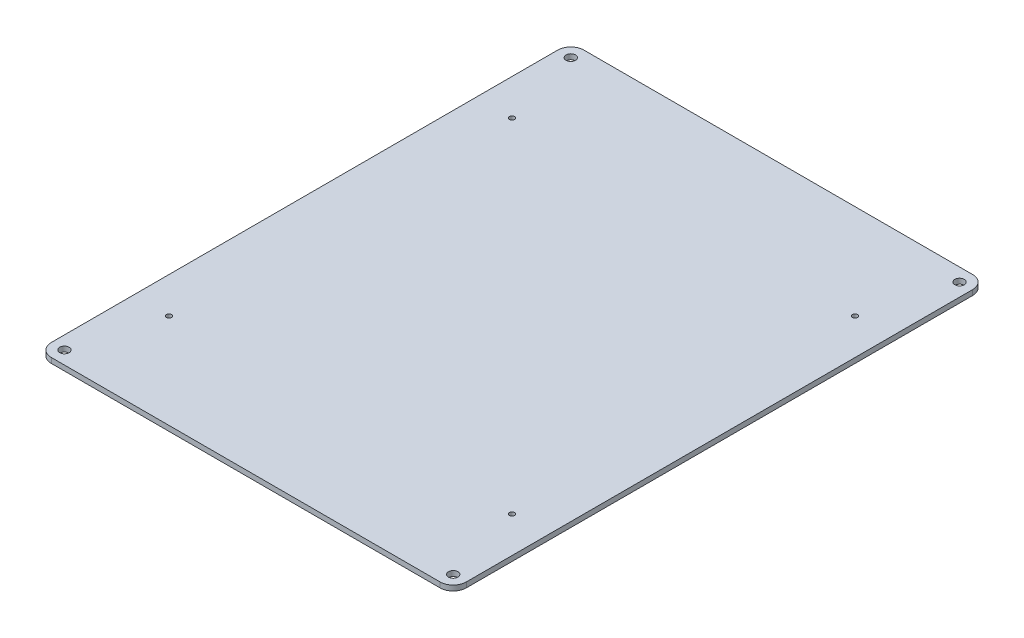
ISO-10303-21;
HEADER;
FILE_DESCRIPTION(('STEP AP214'),'2;1');
FILE_NAME('part.step','',(''),(''),'','','');
FILE_SCHEMA(('AUTOMOTIVE_DESIGN { 1 0 10303 214 1 1 1 1 }'));
ENDSEC;
DATA;
#1=APPLICATION_CONTEXT('core data for automotive mechanical design processes');
#2=APPLICATION_PROTOCOL_DEFINITION('international standard','automotive_design',2000,#1);
#3=PRODUCT_CONTEXT('',#1,'mechanical');
#4=PRODUCT('Part','Part','',(#3));
#5=PRODUCT_RELATED_PRODUCT_CATEGORY('part','',(#4));
#6=PRODUCT_DEFINITION_FORMATION('','',#4);
#7=PRODUCT_DEFINITION_CONTEXT('part definition',#1,'design');
#8=PRODUCT_DEFINITION('design','',#6,#7);
#9=PRODUCT_DEFINITION_SHAPE('','',#8);
#10=(LENGTH_UNIT() NAMED_UNIT(*) SI_UNIT(.MILLI.,.METRE.));
#11=(NAMED_UNIT(*) PLANE_ANGLE_UNIT() SI_UNIT($,.RADIAN.));
#12=(NAMED_UNIT(*) SI_UNIT($,.STERADIAN.) SOLID_ANGLE_UNIT());
#13=UNCERTAINTY_MEASURE_WITH_UNIT(LENGTH_MEASURE(1.E-05),#10,'distance_accuracy_value','');
#14=(GEOMETRIC_REPRESENTATION_CONTEXT(3) GLOBAL_UNCERTAINTY_ASSIGNED_CONTEXT((#13)) GLOBAL_UNIT_ASSIGNED_CONTEXT((#10,
#11,#12)) REPRESENTATION_CONTEXT('',''));
#15=CARTESIAN_POINT('',(0.,0.,0.));
#16=DIRECTION('',(0.,0.,1.));
#17=DIRECTION('',(1.,0.,0.));
#18=AXIS2_PLACEMENT_3D('',#15,#16,#17);
#19=CARTESIAN_POINT('',(-127.,3.175,-163.));
#20=DIRECTION('',(1.,0.,0.));
#21=DIRECTION('',(0.,0.,-1.));
#22=AXIS2_PLACEMENT_3D('',#19,#20,#21);
#23=PLANE('',#22);
#24=DIRECTION('',(0.,0.,1.));
#25=VECTOR('',#24,1.);
#26=CARTESIAN_POINT('',(-127.,3.175,-163.));
#27=LINE('',#26,#25);
#28=CARTESIAN_POINT('',(-127.,3.175,-155.));
#29=VERTEX_POINT('',#28);
#30=CARTESIAN_POINT('',(-127.,3.175,155.));
#31=VERTEX_POINT('',#30);
#32=EDGE_CURVE('E124',#29,#31,#27,.T.);
#33=ORIENTED_EDGE('',*,*,#32,.F.);
#34=DIRECTION('',(0.,-1.,0.));
#35=VECTOR('',#34,1.);
#36=CARTESIAN_POINT('',(-127.,3.175,-155.));
#37=LINE('',#36,#35);
#38=CARTESIAN_POINT('',(-127.,0.,-155.));
#39=VERTEX_POINT('',#38);
#40=EDGE_CURVE('E150',#29,#39,#37,.T.);
#41=ORIENTED_EDGE('',*,*,#40,.T.);
#42=DIRECTION('',(0.,0.,1.));
#43=VECTOR('',#42,1.);
#44=CARTESIAN_POINT('',(-127.,0.,-163.));
#45=LINE('',#44,#43);
#46=CARTESIAN_POINT('',(-127.,0.,155.));
#47=VERTEX_POINT('',#46);
#48=EDGE_CURVE('E156',#39,#47,#45,.T.);
#49=ORIENTED_EDGE('',*,*,#48,.T.);
#50=DIRECTION('',(0.,-1.,0.));
#51=VECTOR('',#50,1.);
#52=CARTESIAN_POINT('',(-127.,3.175,155.));
#53=LINE('',#52,#51);
#54=EDGE_CURVE('E148',#47,#31,#53,.F.);
#55=ORIENTED_EDGE('',*,*,#54,.T.);
#56=EDGE_LOOP('',(#33,#41,#49,#55));
#57=FACE_BOUND('',#56,.T.);
#58=ADVANCED_FACE('F32',(#57),#23,.F.);
#59=CARTESIAN_POINT('',(127.,3.175,163.));
#60=DIRECTION('',(0.,0.,-1.));
#61=DIRECTION('',(-1.,0.,0.));
#62=AXIS2_PLACEMENT_3D('',#59,#60,#61);
#63=PLANE('',#62);
#64=DIRECTION('',(1.,0.,0.));
#65=VECTOR('',#64,1.);
#66=CARTESIAN_POINT('',(127.,3.175,163.));
#67=LINE('',#66,#65);
#68=CARTESIAN_POINT('',(-119.,3.175,163.));
#69=VERTEX_POINT('',#68);
#70=CARTESIAN_POINT('',(119.,3.175,163.));
#71=VERTEX_POINT('',#70);
#72=EDGE_CURVE('E127',#69,#71,#67,.T.);
#73=ORIENTED_EDGE('',*,*,#72,.F.);
#74=DIRECTION('',(0.,-1.,0.));
#75=VECTOR('',#74,1.);
#76=CARTESIAN_POINT('',(-119.,3.175,163.));
#77=LINE('',#76,#75);
#78=CARTESIAN_POINT('',(-119.,0.,163.));
#79=VERTEX_POINT('',#78);
#80=EDGE_CURVE('E11',#69,#79,#77,.T.);
#81=ORIENTED_EDGE('',*,*,#80,.T.);
#82=DIRECTION('',(1.,0.,0.));
#83=VECTOR('',#82,1.);
#84=CARTESIAN_POINT('',(127.,0.,163.));
#85=LINE('',#84,#83);
#86=CARTESIAN_POINT('',(119.,0.,163.));
#87=VERTEX_POINT('',#86);
#88=EDGE_CURVE('E129',#79,#87,#85,.T.);
#89=ORIENTED_EDGE('',*,*,#88,.T.);
#90=DIRECTION('',(0.,-1.,0.));
#91=VECTOR('',#90,1.);
#92=CARTESIAN_POINT('',(119.,3.175,163.));
#93=LINE('',#92,#91);
#94=EDGE_CURVE('E40',#87,#71,#93,.F.);
#95=ORIENTED_EDGE('',*,*,#94,.T.);
#96=EDGE_LOOP('',(#73,#81,#89,#95));
#97=FACE_BOUND('',#96,.T.);
#98=ADVANCED_FACE('F242',(#97),#63,.F.);
#99=CARTESIAN_POINT('',(127.,3.175,-163.));
#100=DIRECTION('',(-1.,0.,0.));
#101=DIRECTION('',(0.,0.,1.));
#102=AXIS2_PLACEMENT_3D('',#99,#100,#101);
#103=PLANE('',#102);
#104=DIRECTION('',(0.,0.,-1.));
#105=VECTOR('',#104,1.);
#106=CARTESIAN_POINT('',(127.,0.,-163.));
#107=LINE('',#106,#105);
#108=CARTESIAN_POINT('',(127.,0.,155.));
#109=VERTEX_POINT('',#108);
#110=CARTESIAN_POINT('',(127.,0.,-155.));
#111=VERTEX_POINT('',#110);
#112=EDGE_CURVE('E125',#109,#111,#107,.T.);
#113=ORIENTED_EDGE('',*,*,#112,.T.);
#114=DIRECTION('',(0.,-1.,0.));
#115=VECTOR('',#114,1.);
#116=CARTESIAN_POINT('',(127.,3.175,-155.));
#117=LINE('',#116,#115);
#118=CARTESIAN_POINT('',(127.,3.175,-155.));
#119=VERTEX_POINT('',#118);
#120=EDGE_CURVE('E103',#111,#119,#117,.F.);
#121=ORIENTED_EDGE('',*,*,#120,.T.);
#122=DIRECTION('',(0.,0.,-1.));
#123=VECTOR('',#122,1.);
#124=CARTESIAN_POINT('',(127.,3.175,-163.));
#125=LINE('',#124,#123);
#126=CARTESIAN_POINT('',(127.,3.175,155.));
#127=VERTEX_POINT('',#126);
#128=EDGE_CURVE('E168',#127,#119,#125,.T.);
#129=ORIENTED_EDGE('',*,*,#128,.F.);
#130=DIRECTION('',(0.,-1.,0.));
#131=VECTOR('',#130,1.);
#132=CARTESIAN_POINT('',(127.,3.175,155.));
#133=LINE('',#132,#131);
#134=EDGE_CURVE('E108',#127,#109,#133,.T.);
#135=ORIENTED_EDGE('',*,*,#134,.T.);
#136=EDGE_LOOP('',(#113,#121,#129,#135));
#137=FACE_BOUND('',#136,.T.);
#138=ADVANCED_FACE('F240',(#137),#103,.F.);
#139=CARTESIAN_POINT('',(127.,3.175,-163.));
#140=DIRECTION('',(0.,0.,1.));
#141=DIRECTION('',(1.,0.,0.));
#142=AXIS2_PLACEMENT_3D('',#139,#140,#141);
#143=PLANE('',#142);
#144=DIRECTION('',(-1.,0.,0.));
#145=VECTOR('',#144,1.);
#146=CARTESIAN_POINT('',(127.,3.175,-163.));
#147=LINE('',#146,#145);
#148=CARTESIAN_POINT('',(119.,3.175,-163.));
#149=VERTEX_POINT('',#148);
#150=CARTESIAN_POINT('',(-119.,3.175,-163.));
#151=VERTEX_POINT('',#150);
#152=EDGE_CURVE('E118',#149,#151,#147,.T.);
#153=ORIENTED_EDGE('',*,*,#152,.F.);
#154=DIRECTION('',(0.,-1.,0.));
#155=VECTOR('',#154,1.);
#156=CARTESIAN_POINT('',(119.,3.175,-163.));
#157=LINE('',#156,#155);
#158=CARTESIAN_POINT('',(119.,0.,-163.));
#159=VERTEX_POINT('',#158);
#160=EDGE_CURVE('E102',#149,#159,#157,.T.);
#161=ORIENTED_EDGE('',*,*,#160,.T.);
#162=DIRECTION('',(-1.,0.,0.));
#163=VECTOR('',#162,1.);
#164=CARTESIAN_POINT('',(127.,0.,-163.));
#165=LINE('',#164,#163);
#166=CARTESIAN_POINT('',(-119.,0.,-163.));
#167=VERTEX_POINT('',#166);
#168=EDGE_CURVE('E115',#159,#167,#165,.T.);
#169=ORIENTED_EDGE('',*,*,#168,.T.);
#170=DIRECTION('',(0.,-1.,0.));
#171=VECTOR('',#170,1.);
#172=CARTESIAN_POINT('',(-119.,3.175,-163.));
#173=LINE('',#172,#171);
#174=EDGE_CURVE('E120',#167,#151,#173,.F.);
#175=ORIENTED_EDGE('',*,*,#174,.T.);
#176=EDGE_LOOP('',(#153,#161,#169,#175));
#177=FACE_BOUND('',#176,.T.);
#178=ADVANCED_FACE('F114',(#177),#143,.F.);
#179=CARTESIAN_POINT('',(0.,3.175,0.));
#180=DIRECTION('',(0.,-1.,0.));
#181=DIRECTION('',(0.,0.,-1.));
#182=AXIS2_PLACEMENT_3D('',#179,#180,#181);
#183=PLANE('',#182);
#184=CARTESIAN_POINT('',(-119.,3.175,-155.));
#185=DIRECTION('',(0.,1.,0.));
#186=DIRECTION('',(0.,0.,1.));
#187=AXIS2_PLACEMENT_3D('',#184,#185,#186);
#188=CIRCLE('',#187,2.9);
#189=CARTESIAN_POINT('',(-119.,3.175,-152.1));
#190=VERTEX_POINT('',#189);
#191=EDGE_CURVE('E213',#190,#190,#188,.T.);
#192=ORIENTED_EDGE('',*,*,#191,.F.);
#193=EDGE_LOOP('',(#192));
#194=FACE_BOUND('',#193,.T.);
#195=CARTESIAN_POINT('',(119.,3.175,-155.));
#196=DIRECTION('',(0.,1.,0.));
#197=DIRECTION('',(0.,0.,1.));
#198=AXIS2_PLACEMENT_3D('',#195,#196,#197);
#199=CIRCLE('',#198,2.9);
#200=CARTESIAN_POINT('',(119.,3.175,-152.1));
#201=VERTEX_POINT('',#200);
#202=EDGE_CURVE('E207',#201,#201,#199,.T.);
#203=ORIENTED_EDGE('',*,*,#202,.F.);
#204=EDGE_LOOP('',(#203));
#205=FACE_BOUND('',#204,.T.);
#206=CARTESIAN_POINT('',(119.,3.175,155.));
#207=DIRECTION('',(0.,1.,0.));
#208=DIRECTION('',(0.,0.,1.));
#209=AXIS2_PLACEMENT_3D('',#206,#207,#208);
#210=CIRCLE('',#209,2.9);
#211=CARTESIAN_POINT('',(119.,3.175,157.9));
#212=VERTEX_POINT('',#211);
#213=EDGE_CURVE('E201',#212,#212,#210,.T.);
#214=ORIENTED_EDGE('',*,*,#213,.F.);
#215=EDGE_LOOP('',(#214));
#216=FACE_BOUND('',#215,.T.);
#217=CARTESIAN_POINT('',(-119.,3.175,155.));
#218=DIRECTION('',(0.,1.,0.));
#219=DIRECTION('',(0.,0.,1.));
#220=AXIS2_PLACEMENT_3D('',#217,#218,#219);
#221=CIRCLE('',#220,2.9);
#222=CARTESIAN_POINT('',(-119.,3.175,157.9));
#223=VERTEX_POINT('',#222);
#224=EDGE_CURVE('E195',#223,#223,#221,.T.);
#225=ORIENTED_EDGE('',*,*,#224,.F.);
#226=EDGE_LOOP('',(#225));
#227=FACE_BOUND('',#226,.T.);
#228=CARTESIAN_POINT('',(-105.,3.175,105.));
#229=DIRECTION('',(0.,1.,0.));
#230=DIRECTION('',(0.,0.,1.));
#231=AXIS2_PLACEMENT_3D('',#228,#229,#230);
#232=CIRCLE('',#231,1.54999999999998);
#233=CARTESIAN_POINT('',(-105.,3.175,106.55));
#234=VERTEX_POINT('',#233);
#235=EDGE_CURVE('E189',#234,#234,#232,.T.);
#236=ORIENTED_EDGE('',*,*,#235,.F.);
#237=EDGE_LOOP('',(#236));
#238=FACE_BOUND('',#237,.T.);
#239=CARTESIAN_POINT('',(-105.,3.175,-105.));
#240=DIRECTION('',(0.,1.,0.));
#241=DIRECTION('',(0.,0.,1.));
#242=AXIS2_PLACEMENT_3D('',#239,#240,#241);
#243=CIRCLE('',#242,1.54999999999998);
#244=CARTESIAN_POINT('',(-105.,3.175,-103.45));
#245=VERTEX_POINT('',#244);
#246=EDGE_CURVE('E183',#245,#245,#243,.T.);
#247=ORIENTED_EDGE('',*,*,#246,.F.);
#248=EDGE_LOOP('',(#247));
#249=FACE_BOUND('',#248,.T.);
#250=CARTESIAN_POINT('',(105.,3.175,-105.));
#251=DIRECTION('',(0.,1.,0.));
#252=DIRECTION('',(0.,0.,1.));
#253=AXIS2_PLACEMENT_3D('',#250,#251,#252);
#254=CIRCLE('',#253,1.54999999999998);
#255=CARTESIAN_POINT('',(105.,3.175,-103.45));
#256=VERTEX_POINT('',#255);
#257=EDGE_CURVE('E177',#256,#256,#254,.T.);
#258=ORIENTED_EDGE('',*,*,#257,.F.);
#259=EDGE_LOOP('',(#258));
#260=FACE_BOUND('',#259,.T.);
#261=CARTESIAN_POINT('',(105.,3.175,105.));
#262=DIRECTION('',(0.,1.,0.));
#263=DIRECTION('',(0.,0.,1.));
#264=AXIS2_PLACEMENT_3D('',#261,#262,#263);
#265=CIRCLE('',#264,1.54999999999998);
#266=CARTESIAN_POINT('',(105.,3.175,106.55));
#267=VERTEX_POINT('',#266);
#268=EDGE_CURVE('E164',#267,#267,#265,.T.);
#269=ORIENTED_EDGE('',*,*,#268,.F.);
#270=EDGE_LOOP('',(#269));
#271=FACE_BOUND('',#270,.T.);
#272=ORIENTED_EDGE('',*,*,#128,.T.);
#273=CARTESIAN_POINT('',(119.,3.175,-155.));
#274=DIRECTION('',(0.,-1.,0.));
#275=DIRECTION('',(0.,0.,-1.));
#276=AXIS2_PLACEMENT_3D('',#273,#274,#275);
#277=CIRCLE('',#276,8.);
#278=EDGE_CURVE('E146',#119,#149,#277,.F.);
#279=ORIENTED_EDGE('',*,*,#278,.T.);
#280=ORIENTED_EDGE('',*,*,#152,.T.);
#281=CARTESIAN_POINT('',(-119.,3.175,-155.));
#282=DIRECTION('',(0.,-1.,0.));
#283=DIRECTION('',(0.,0.,-1.));
#284=AXIS2_PLACEMENT_3D('',#281,#282,#283);
#285=CIRCLE('',#284,8.);
#286=EDGE_CURVE('E144',#151,#29,#285,.F.);
#287=ORIENTED_EDGE('',*,*,#286,.T.);
#288=ORIENTED_EDGE('',*,*,#32,.T.);
#289=CARTESIAN_POINT('',(-119.,3.175,155.));
#290=DIRECTION('',(0.,-1.,0.));
#291=DIRECTION('',(0.,0.,-1.));
#292=AXIS2_PLACEMENT_3D('',#289,#290,#291);
#293=CIRCLE('',#292,8.);
#294=EDGE_CURVE('E53',#31,#69,#293,.F.);
#295=ORIENTED_EDGE('',*,*,#294,.T.);
#296=ORIENTED_EDGE('',*,*,#72,.T.);
#297=CARTESIAN_POINT('',(119.,3.175,155.));
#298=DIRECTION('',(0.,-1.,0.));
#299=DIRECTION('',(0.,0.,-1.));
#300=AXIS2_PLACEMENT_3D('',#297,#298,#299);
#301=CIRCLE('',#300,8.);
#302=EDGE_CURVE('E141',#71,#127,#301,.F.);
#303=ORIENTED_EDGE('',*,*,#302,.T.);
#304=EDGE_LOOP('',(#272,#279,#280,#287,#288,#295,#296,#303));
#305=FACE_BOUND('',#304,.T.);
#306=ADVANCED_FACE('F219',(#194,#205,#216,#227,#238,#249,#260,#271,#305),#183,.F.);
#307=CARTESIAN_POINT('',(0.,0.,0.));
#308=DIRECTION('',(0.,-1.,0.));
#309=DIRECTION('',(0.,0.,-1.));
#310=AXIS2_PLACEMENT_3D('',#307,#308,#309);
#311=PLANE('',#310);
#312=CARTESIAN_POINT('',(-119.,0.,-155.));
#313=DIRECTION('',(0.,-1.,0.));
#314=DIRECTION('',(0.,0.,-1.));
#315=AXIS2_PLACEMENT_3D('',#312,#313,#314);
#316=CIRCLE('',#315,2.9);
#317=CARTESIAN_POINT('',(-119.,0.,-157.9));
#318=VERTEX_POINT('',#317);
#319=EDGE_CURVE('E210',#318,#318,#316,.T.);
#320=ORIENTED_EDGE('',*,*,#319,.F.);
#321=EDGE_LOOP('',(#320));
#322=FACE_BOUND('',#321,.T.);
#323=CARTESIAN_POINT('',(119.,0.,-155.));
#324=DIRECTION('',(0.,-1.,0.));
#325=DIRECTION('',(0.,0.,-1.));
#326=AXIS2_PLACEMENT_3D('',#323,#324,#325);
#327=CIRCLE('',#326,2.9);
#328=CARTESIAN_POINT('',(119.,0.,-157.9));
#329=VERTEX_POINT('',#328);
#330=EDGE_CURVE('E204',#329,#329,#327,.T.);
#331=ORIENTED_EDGE('',*,*,#330,.F.);
#332=EDGE_LOOP('',(#331));
#333=FACE_BOUND('',#332,.T.);
#334=CARTESIAN_POINT('',(119.,0.,155.));
#335=DIRECTION('',(0.,-1.,0.));
#336=DIRECTION('',(0.,0.,-1.));
#337=AXIS2_PLACEMENT_3D('',#334,#335,#336);
#338=CIRCLE('',#337,2.9);
#339=CARTESIAN_POINT('',(119.,0.,152.1));
#340=VERTEX_POINT('',#339);
#341=EDGE_CURVE('E198',#340,#340,#338,.T.);
#342=ORIENTED_EDGE('',*,*,#341,.F.);
#343=EDGE_LOOP('',(#342));
#344=FACE_BOUND('',#343,.T.);
#345=CARTESIAN_POINT('',(-119.,0.,155.));
#346=DIRECTION('',(0.,-1.,0.));
#347=DIRECTION('',(0.,0.,-1.));
#348=AXIS2_PLACEMENT_3D('',#345,#346,#347);
#349=CIRCLE('',#348,2.9);
#350=CARTESIAN_POINT('',(-119.,0.,152.1));
#351=VERTEX_POINT('',#350);
#352=EDGE_CURVE('E192',#351,#351,#349,.T.);
#353=ORIENTED_EDGE('',*,*,#352,.F.);
#354=EDGE_LOOP('',(#353));
#355=FACE_BOUND('',#354,.T.);
#356=CARTESIAN_POINT('',(-105.,0.,105.));
#357=DIRECTION('',(0.,-1.,0.));
#358=DIRECTION('',(0.,0.,-1.));
#359=AXIS2_PLACEMENT_3D('',#356,#357,#358);
#360=CIRCLE('',#359,1.54999999999998);
#361=CARTESIAN_POINT('',(-105.,0.,103.45));
#362=VERTEX_POINT('',#361);
#363=EDGE_CURVE('E186',#362,#362,#360,.T.);
#364=ORIENTED_EDGE('',*,*,#363,.F.);
#365=EDGE_LOOP('',(#364));
#366=FACE_BOUND('',#365,.T.);
#367=CARTESIAN_POINT('',(-105.,0.,-105.));
#368=DIRECTION('',(0.,-1.,0.));
#369=DIRECTION('',(0.,0.,-1.));
#370=AXIS2_PLACEMENT_3D('',#367,#368,#369);
#371=CIRCLE('',#370,1.54999999999998);
#372=CARTESIAN_POINT('',(-105.,0.,-106.55));
#373=VERTEX_POINT('',#372);
#374=EDGE_CURVE('E180',#373,#373,#371,.T.);
#375=ORIENTED_EDGE('',*,*,#374,.F.);
#376=EDGE_LOOP('',(#375));
#377=FACE_BOUND('',#376,.T.);
#378=CARTESIAN_POINT('',(105.,0.,-105.));
#379=DIRECTION('',(0.,-1.,0.));
#380=DIRECTION('',(0.,0.,-1.));
#381=AXIS2_PLACEMENT_3D('',#378,#379,#380);
#382=CIRCLE('',#381,1.54999999999998);
#383=CARTESIAN_POINT('',(105.,0.,-106.55));
#384=VERTEX_POINT('',#383);
#385=EDGE_CURVE('E174',#384,#384,#382,.T.);
#386=ORIENTED_EDGE('',*,*,#385,.F.);
#387=EDGE_LOOP('',(#386));
#388=FACE_BOUND('',#387,.T.);
#389=CARTESIAN_POINT('',(105.,0.,105.));
#390=DIRECTION('',(0.,-1.,0.));
#391=DIRECTION('',(0.,0.,-1.));
#392=AXIS2_PLACEMENT_3D('',#389,#390,#391);
#393=CIRCLE('',#392,1.54999999999998);
#394=CARTESIAN_POINT('',(105.,0.,103.45));
#395=VERTEX_POINT('',#394);
#396=EDGE_CURVE('E161',#395,#395,#393,.T.);
#397=ORIENTED_EDGE('',*,*,#396,.F.);
#398=EDGE_LOOP('',(#397));
#399=FACE_BOUND('',#398,.T.);
#400=ORIENTED_EDGE('',*,*,#168,.F.);
#401=CARTESIAN_POINT('',(119.,0.,-155.));
#402=DIRECTION('',(0.,-1.,0.));
#403=DIRECTION('',(0.,0.,-1.));
#404=AXIS2_PLACEMENT_3D('',#401,#402,#403);
#405=CIRCLE('',#404,8.);
#406=EDGE_CURVE('E98',#159,#111,#405,.T.);
#407=ORIENTED_EDGE('',*,*,#406,.T.);
#408=ORIENTED_EDGE('',*,*,#112,.F.);
#409=CARTESIAN_POINT('',(119.,0.,155.));
#410=DIRECTION('',(0.,-1.,0.));
#411=DIRECTION('',(0.,0.,-1.));
#412=AXIS2_PLACEMENT_3D('',#409,#410,#411);
#413=CIRCLE('',#412,8.);
#414=EDGE_CURVE('E119',#109,#87,#413,.T.);
#415=ORIENTED_EDGE('',*,*,#414,.T.);
#416=ORIENTED_EDGE('',*,*,#88,.F.);
#417=CARTESIAN_POINT('',(-119.,0.,155.));
#418=DIRECTION('',(0.,-1.,0.));
#419=DIRECTION('',(0.,0.,-1.));
#420=AXIS2_PLACEMENT_3D('',#417,#418,#419);
#421=CIRCLE('',#420,8.);
#422=EDGE_CURVE('E135',#79,#47,#421,.T.);
#423=ORIENTED_EDGE('',*,*,#422,.T.);
#424=ORIENTED_EDGE('',*,*,#48,.F.);
#425=CARTESIAN_POINT('',(-119.,0.,-155.));
#426=DIRECTION('',(0.,-1.,0.));
#427=DIRECTION('',(0.,0.,-1.));
#428=AXIS2_PLACEMENT_3D('',#425,#426,#427);
#429=CIRCLE('',#428,8.);
#430=EDGE_CURVE('E109',#39,#167,#429,.T.);
#431=ORIENTED_EDGE('',*,*,#430,.T.);
#432=EDGE_LOOP('',(#400,#407,#408,#415,#416,#423,#424,#431));
#433=FACE_BOUND('',#432,.T.);
#434=ADVANCED_FACE('F122',(#322,#333,#344,#355,#366,#377,#388,#399,#433),#311,.T.);
#435=CARTESIAN_POINT('',(105.,3.175,105.));
#436=DIRECTION('',(0.,1.,0.));
#437=DIRECTION('',(0.,0.,1.));
#438=AXIS2_PLACEMENT_3D('',#435,#436,#437);
#439=CYLINDRICAL_SURFACE('',#438,1.54999999999998);
#440=ORIENTED_EDGE('',*,*,#396,.T.);
#441=EDGE_LOOP('',(#440));
#442=FACE_BOUND('',#441,.T.);
#443=ORIENTED_EDGE('',*,*,#268,.T.);
#444=EDGE_LOOP('',(#443));
#445=FACE_BOUND('',#444,.T.);
#446=ADVANCED_FACE('F267',(#442,#445),#439,.F.);
#447=CARTESIAN_POINT('',(105.,3.175,-105.));
#448=DIRECTION('',(0.,1.,0.));
#449=DIRECTION('',(0.,0.,1.));
#450=AXIS2_PLACEMENT_3D('',#447,#448,#449);
#451=CYLINDRICAL_SURFACE('',#450,1.54999999999998);
#452=ORIENTED_EDGE('',*,*,#385,.T.);
#453=EDGE_LOOP('',(#452));
#454=FACE_BOUND('',#453,.T.);
#455=ORIENTED_EDGE('',*,*,#257,.T.);
#456=EDGE_LOOP('',(#455));
#457=FACE_BOUND('',#456,.T.);
#458=ADVANCED_FACE('F272',(#454,#457),#451,.F.);
#459=CARTESIAN_POINT('',(-105.,3.175,-105.));
#460=DIRECTION('',(0.,1.,0.));
#461=DIRECTION('',(0.,0.,1.));
#462=AXIS2_PLACEMENT_3D('',#459,#460,#461);
#463=CYLINDRICAL_SURFACE('',#462,1.54999999999998);
#464=ORIENTED_EDGE('',*,*,#374,.T.);
#465=EDGE_LOOP('',(#464));
#466=FACE_BOUND('',#465,.T.);
#467=ORIENTED_EDGE('',*,*,#246,.T.);
#468=EDGE_LOOP('',(#467));
#469=FACE_BOUND('',#468,.T.);
#470=ADVANCED_FACE('F276',(#466,#469),#463,.F.);
#471=CARTESIAN_POINT('',(-105.,3.175,105.));
#472=DIRECTION('',(0.,1.,0.));
#473=DIRECTION('',(0.,0.,1.));
#474=AXIS2_PLACEMENT_3D('',#471,#472,#473);
#475=CYLINDRICAL_SURFACE('',#474,1.54999999999998);
#476=ORIENTED_EDGE('',*,*,#363,.T.);
#477=EDGE_LOOP('',(#476));
#478=FACE_BOUND('',#477,.T.);
#479=ORIENTED_EDGE('',*,*,#235,.T.);
#480=EDGE_LOOP('',(#479));
#481=FACE_BOUND('',#480,.T.);
#482=ADVANCED_FACE('F280',(#478,#481),#475,.F.);
#483=CARTESIAN_POINT('',(-119.,3.175,155.));
#484=DIRECTION('',(0.,1.,0.));
#485=DIRECTION('',(0.,0.,1.));
#486=AXIS2_PLACEMENT_3D('',#483,#484,#485);
#487=CYLINDRICAL_SURFACE('',#486,2.9);
#488=ORIENTED_EDGE('',*,*,#352,.T.);
#489=EDGE_LOOP('',(#488));
#490=FACE_BOUND('',#489,.T.);
#491=ORIENTED_EDGE('',*,*,#224,.T.);
#492=EDGE_LOOP('',(#491));
#493=FACE_BOUND('',#492,.T.);
#494=ADVANCED_FACE('F284',(#490,#493),#487,.F.);
#495=CARTESIAN_POINT('',(119.,3.175,155.));
#496=DIRECTION('',(0.,1.,0.));
#497=DIRECTION('',(0.,0.,1.));
#498=AXIS2_PLACEMENT_3D('',#495,#496,#497);
#499=CYLINDRICAL_SURFACE('',#498,2.9);
#500=ORIENTED_EDGE('',*,*,#341,.T.);
#501=EDGE_LOOP('',(#500));
#502=FACE_BOUND('',#501,.T.);
#503=ORIENTED_EDGE('',*,*,#213,.T.);
#504=EDGE_LOOP('',(#503));
#505=FACE_BOUND('',#504,.T.);
#506=ADVANCED_FACE('F288',(#502,#505),#499,.F.);
#507=CARTESIAN_POINT('',(119.,3.175,-155.));
#508=DIRECTION('',(0.,1.,0.));
#509=DIRECTION('',(0.,0.,1.));
#510=AXIS2_PLACEMENT_3D('',#507,#508,#509);
#511=CYLINDRICAL_SURFACE('',#510,2.9);
#512=ORIENTED_EDGE('',*,*,#330,.T.);
#513=EDGE_LOOP('',(#512));
#514=FACE_BOUND('',#513,.T.);
#515=ORIENTED_EDGE('',*,*,#202,.T.);
#516=EDGE_LOOP('',(#515));
#517=FACE_BOUND('',#516,.T.);
#518=ADVANCED_FACE('F292',(#514,#517),#511,.F.);
#519=CARTESIAN_POINT('',(-119.,3.175,-155.));
#520=DIRECTION('',(0.,1.,0.));
#521=DIRECTION('',(0.,0.,1.));
#522=AXIS2_PLACEMENT_3D('',#519,#520,#521);
#523=CYLINDRICAL_SURFACE('',#522,2.9);
#524=ORIENTED_EDGE('',*,*,#319,.T.);
#525=EDGE_LOOP('',(#524));
#526=FACE_BOUND('',#525,.T.);
#527=ORIENTED_EDGE('',*,*,#191,.T.);
#528=EDGE_LOOP('',(#527));
#529=FACE_BOUND('',#528,.T.);
#530=ADVANCED_FACE('F217',(#526,#529),#523,.F.);
#531=CARTESIAN_POINT('',(119.,3.175,-155.));
#532=DIRECTION('',(0.,-1.,0.));
#533=DIRECTION('',(0.,0.,-1.));
#534=AXIS2_PLACEMENT_3D('',#531,#532,#533);
#535=CYLINDRICAL_SURFACE('',#534,8.);
#536=ORIENTED_EDGE('',*,*,#278,.F.);
#537=ORIENTED_EDGE('',*,*,#120,.F.);
#538=ORIENTED_EDGE('',*,*,#406,.F.);
#539=ORIENTED_EDGE('',*,*,#160,.F.);
#540=EDGE_LOOP('',(#536,#537,#538,#539));
#541=FACE_BOUND('',#540,.T.);
#542=ADVANCED_FACE('F101',(#541),#535,.T.);
#543=CARTESIAN_POINT('',(-119.,3.175,-155.));
#544=DIRECTION('',(0.,-1.,0.));
#545=DIRECTION('',(0.,0.,-1.));
#546=AXIS2_PLACEMENT_3D('',#543,#544,#545);
#547=CYLINDRICAL_SURFACE('',#546,8.);
#548=ORIENTED_EDGE('',*,*,#286,.F.);
#549=ORIENTED_EDGE('',*,*,#174,.F.);
#550=ORIENTED_EDGE('',*,*,#430,.F.);
#551=ORIENTED_EDGE('',*,*,#40,.F.);
#552=EDGE_LOOP('',(#548,#549,#550,#551));
#553=FACE_BOUND('',#552,.T.);
#554=ADVANCED_FACE('F246',(#553),#547,.T.);
#555=CARTESIAN_POINT('',(-119.,3.175,155.));
#556=DIRECTION('',(0.,-1.,0.));
#557=DIRECTION('',(0.,0.,-1.));
#558=AXIS2_PLACEMENT_3D('',#555,#556,#557);
#559=CYLINDRICAL_SURFACE('',#558,8.);
#560=ORIENTED_EDGE('',*,*,#294,.F.);
#561=ORIENTED_EDGE('',*,*,#54,.F.);
#562=ORIENTED_EDGE('',*,*,#422,.F.);
#563=ORIENTED_EDGE('',*,*,#80,.F.);
#564=EDGE_LOOP('',(#560,#561,#562,#563));
#565=FACE_BOUND('',#564,.T.);
#566=ADVANCED_FACE('F245',(#565),#559,.T.);
#567=CARTESIAN_POINT('',(119.,3.175,155.));
#568=DIRECTION('',(0.,-1.,0.));
#569=DIRECTION('',(0.,0.,-1.));
#570=AXIS2_PLACEMENT_3D('',#567,#568,#569);
#571=CYLINDRICAL_SURFACE('',#570,8.);
#572=ORIENTED_EDGE('',*,*,#302,.F.);
#573=ORIENTED_EDGE('',*,*,#94,.F.);
#574=ORIENTED_EDGE('',*,*,#414,.F.);
#575=ORIENTED_EDGE('',*,*,#134,.F.);
#576=EDGE_LOOP('',(#572,#573,#574,#575));
#577=FACE_BOUND('',#576,.T.);
#578=ADVANCED_FACE('F34',(#577),#571,.T.);
#579=CLOSED_SHELL('',(#58,#98,#138,#178,#306,#434,#446,#458,#470,#482,#494,#506,#518,#530,#542,
#554,#566,#578));
#580=MANIFOLD_SOLID_BREP('B2',#579);
#581=ADVANCED_BREP_SHAPE_REPRESENTATION('',(#18,#580),#14);
#582=SHAPE_DEFINITION_REPRESENTATION(#9,#581);
ENDSEC;
END-ISO-10303-21;
